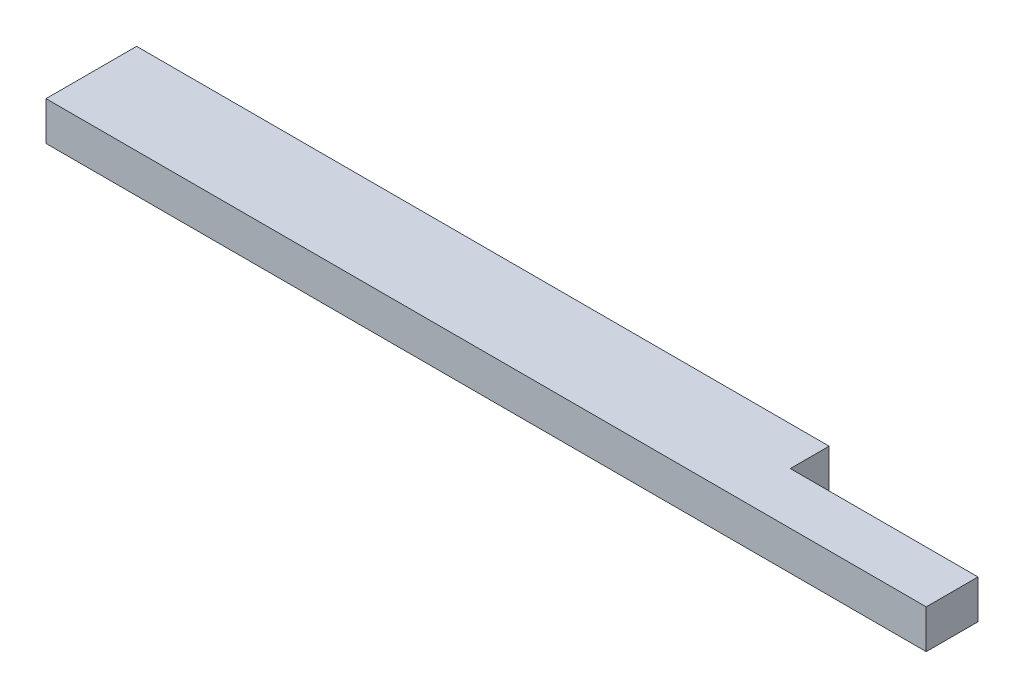
ISO-10303-21;
HEADER;
FILE_DESCRIPTION(('STEP AP214'),'2;1');
FILE_NAME('part.step','',(''),(''),'','','');
FILE_SCHEMA(('AUTOMOTIVE_DESIGN { 1 0 10303 214 1 1 1 1 }'));
ENDSEC;
DATA;
#1=APPLICATION_CONTEXT('core data for automotive mechanical design processes');
#2=APPLICATION_PROTOCOL_DEFINITION('international standard','automotive_design',2000,#1);
#3=PRODUCT_CONTEXT('',#1,'mechanical');
#4=PRODUCT('Part','Part','',(#3));
#5=PRODUCT_RELATED_PRODUCT_CATEGORY('part','',(#4));
#6=PRODUCT_DEFINITION_FORMATION('','',#4);
#7=PRODUCT_DEFINITION_CONTEXT('part definition',#1,'design');
#8=PRODUCT_DEFINITION('design','',#6,#7);
#9=PRODUCT_DEFINITION_SHAPE('','',#8);
#10=(LENGTH_UNIT() NAMED_UNIT(*) SI_UNIT(.MILLI.,.METRE.));
#11=(NAMED_UNIT(*) PLANE_ANGLE_UNIT() SI_UNIT($,.RADIAN.));
#12=(NAMED_UNIT(*) SI_UNIT($,.STERADIAN.) SOLID_ANGLE_UNIT());
#13=UNCERTAINTY_MEASURE_WITH_UNIT(LENGTH_MEASURE(1.E-05),#10,'distance_accuracy_value','');
#14=(GEOMETRIC_REPRESENTATION_CONTEXT(3) GLOBAL_UNCERTAINTY_ASSIGNED_CONTEXT((#13)) GLOBAL_UNIT_ASSIGNED_CONTEXT((#10,
#11,#12)) REPRESENTATION_CONTEXT('',''));
#15=CARTESIAN_POINT('',(0.,0.,0.));
#16=DIRECTION('',(0.,0.,1.));
#17=DIRECTION('',(1.,0.,0.));
#18=AXIS2_PLACEMENT_3D('',#15,#16,#17);
#19=CARTESIAN_POINT('',(0.,38.1,0.));
#20=DIRECTION('',(1.,0.,0.));
#21=DIRECTION('',(0.,0.,-1.));
#22=AXIS2_PLACEMENT_3D('',#19,#20,#21);
#23=PLANE('',#22);
#24=DIRECTION('',(0.,0.,1.));
#25=VECTOR('',#24,1.);
#26=CARTESIAN_POINT('',(0.,0.,0.));
#27=LINE('',#26,#25);
#28=CARTESIAN_POINT('',(0.,0.,-88.9));
#29=VERTEX_POINT('',#28);
#30=CARTESIAN_POINT('',(0.,0.,0.));
#31=VERTEX_POINT('',#30);
#32=EDGE_CURVE('E113',#29,#31,#27,.T.);
#33=ORIENTED_EDGE('',*,*,#32,.T.);
#34=DIRECTION('',(0.,-1.,0.));
#35=VECTOR('',#34,1.);
#36=CARTESIAN_POINT('',(0.,38.1,0.));
#37=LINE('',#36,#35);
#38=CARTESIAN_POINT('',(0.,38.1,0.));
#39=VERTEX_POINT('',#38);
#40=EDGE_CURVE('E11',#39,#31,#37,.T.);
#41=ORIENTED_EDGE('',*,*,#40,.F.);
#42=DIRECTION('',(0.,0.,1.));
#43=VECTOR('',#42,1.);
#44=CARTESIAN_POINT('',(0.,38.1,0.));
#45=LINE('',#44,#43);
#46=CARTESIAN_POINT('',(0.,38.1,-88.9));
#47=VERTEX_POINT('',#46);
#48=EDGE_CURVE('E114',#47,#39,#45,.T.);
#49=ORIENTED_EDGE('',*,*,#48,.F.);
#50=DIRECTION('',(0.,-1.,0.));
#51=VECTOR('',#50,1.);
#52=CARTESIAN_POINT('',(0.,38.1,-88.9));
#53=LINE('',#52,#51);
#54=EDGE_CURVE('E123',#47,#29,#53,.T.);
#55=ORIENTED_EDGE('',*,*,#54,.T.);
#56=EDGE_LOOP('',(#33,#41,#49,#55));
#57=FACE_BOUND('',#56,.T.);
#58=ADVANCED_FACE('F39',(#57),#23,.F.);
#59=CARTESIAN_POINT('',(0.,38.1,0.));
#60=DIRECTION('',(0.,0.,-1.));
#61=DIRECTION('',(-1.,0.,0.));
#62=AXIS2_PLACEMENT_3D('',#59,#60,#61);
#63=PLANE('',#62);
#64=DIRECTION('',(1.,0.,0.));
#65=VECTOR('',#64,1.);
#66=CARTESIAN_POINT('',(0.,0.,0.));
#67=LINE('',#66,#65);
#68=CARTESIAN_POINT('',(863.6,0.,0.));
#69=VERTEX_POINT('',#68);
#70=EDGE_CURVE('E119',#31,#69,#67,.T.);
#71=ORIENTED_EDGE('',*,*,#70,.T.);
#72=DIRECTION('',(0.,-1.,0.));
#73=VECTOR('',#72,1.);
#74=CARTESIAN_POINT('',(863.6,38.1,0.));
#75=LINE('',#74,#73);
#76=CARTESIAN_POINT('',(863.6,38.1,0.));
#77=VERTEX_POINT('',#76);
#78=EDGE_CURVE('E46',#77,#69,#75,.T.);
#79=ORIENTED_EDGE('',*,*,#78,.F.);
#80=DIRECTION('',(1.,0.,0.));
#81=VECTOR('',#80,1.);
#82=CARTESIAN_POINT('',(0.,38.1,0.));
#83=LINE('',#82,#81);
#84=EDGE_CURVE('E85',#39,#77,#83,.T.);
#85=ORIENTED_EDGE('',*,*,#84,.F.);
#86=ORIENTED_EDGE('',*,*,#40,.T.);
#87=EDGE_LOOP('',(#71,#79,#85,#86));
#88=FACE_BOUND('',#87,.T.);
#89=ADVANCED_FACE('F143',(#88),#63,.F.);
#90=CARTESIAN_POINT('',(863.6,38.1,0.));
#91=DIRECTION('',(-1.,0.,0.));
#92=DIRECTION('',(0.,0.,1.));
#93=AXIS2_PLACEMENT_3D('',#90,#91,#92);
#94=PLANE('',#93);
#95=DIRECTION('',(0.,0.,-1.));
#96=VECTOR('',#95,1.);
#97=CARTESIAN_POINT('',(863.6,0.,0.));
#98=LINE('',#97,#96);
#99=CARTESIAN_POINT('',(863.6,0.,-50.8));
#100=VERTEX_POINT('',#99);
#101=EDGE_CURVE('E115',#69,#100,#98,.T.);
#102=ORIENTED_EDGE('',*,*,#101,.T.);
#103=DIRECTION('',(0.,1.,0.));
#104=VECTOR('',#103,1.);
#105=CARTESIAN_POINT('',(863.6,0.,-50.8));
#106=LINE('',#105,#104);
#107=CARTESIAN_POINT('',(863.6,38.1,-50.8));
#108=VERTEX_POINT('',#107);
#109=EDGE_CURVE('E137',#100,#108,#106,.T.);
#110=ORIENTED_EDGE('',*,*,#109,.T.);
#111=DIRECTION('',(0.,0.,-1.));
#112=VECTOR('',#111,1.);
#113=CARTESIAN_POINT('',(863.6,38.1,0.));
#114=LINE('',#113,#112);
#115=EDGE_CURVE('E131',#77,#108,#114,.T.);
#116=ORIENTED_EDGE('',*,*,#115,.F.);
#117=ORIENTED_EDGE('',*,*,#78,.T.);
#118=EDGE_LOOP('',(#102,#110,#116,#117));
#119=FACE_BOUND('',#118,.T.);
#120=ADVANCED_FACE('F128',(#119),#94,.F.);
#121=CARTESIAN_POINT('',(0.,38.1,-88.9));
#122=DIRECTION('',(0.,0.,1.));
#123=DIRECTION('',(1.,0.,0.));
#124=AXIS2_PLACEMENT_3D('',#121,#122,#123);
#125=PLANE('',#124);
#126=DIRECTION('',(-1.,0.,0.));
#127=VECTOR('',#126,1.);
#128=CARTESIAN_POINT('',(0.,38.1,-88.9));
#129=LINE('',#128,#127);
#130=CARTESIAN_POINT('',(679.45,38.1,-88.8999999999999));
#131=VERTEX_POINT('',#130);
#132=EDGE_CURVE('E62',#131,#47,#129,.T.);
#133=ORIENTED_EDGE('',*,*,#132,.F.);
#134=DIRECTION('',(0.,1.,0.));
#135=VECTOR('',#134,1.);
#136=CARTESIAN_POINT('',(679.45,0.,-88.8999999999999));
#137=LINE('',#136,#135);
#138=CARTESIAN_POINT('',(679.45,0.,-88.8999999999999));
#139=VERTEX_POINT('',#138);
#140=EDGE_CURVE('E103',#139,#131,#137,.T.);
#141=ORIENTED_EDGE('',*,*,#140,.F.);
#142=DIRECTION('',(-1.,0.,0.));
#143=VECTOR('',#142,1.);
#144=CARTESIAN_POINT('',(0.,0.,-88.9));
#145=LINE('',#144,#143);
#146=EDGE_CURVE('E80',#139,#29,#145,.T.);
#147=ORIENTED_EDGE('',*,*,#146,.T.);
#148=ORIENTED_EDGE('',*,*,#54,.F.);
#149=EDGE_LOOP('',(#133,#141,#147,#148));
#150=FACE_BOUND('',#149,.T.);
#151=ADVANCED_FACE('F108',(#150),#125,.F.);
#152=CARTESIAN_POINT('',(0.,38.1,0.));
#153=DIRECTION('',(0.,-1.,0.));
#154=DIRECTION('',(0.,0.,-1.));
#155=AXIS2_PLACEMENT_3D('',#152,#153,#154);
#156=PLANE('',#155);
#157=ORIENTED_EDGE('',*,*,#115,.T.);
#158=DIRECTION('',(1.,0.,0.));
#159=VECTOR('',#158,1.);
#160=CARTESIAN_POINT('',(863.6,38.1,-50.8));
#161=LINE('',#160,#159);
#162=CARTESIAN_POINT('',(679.45,38.1,-50.8));
#163=VERTEX_POINT('',#162);
#164=EDGE_CURVE('E106',#163,#108,#161,.T.);
#165=ORIENTED_EDGE('',*,*,#164,.F.);
#166=DIRECTION('',(0.,0.,1.));
#167=VECTOR('',#166,1.);
#168=CARTESIAN_POINT('',(679.45,38.1,-88.8999999999999));
#169=LINE('',#168,#167);
#170=EDGE_CURVE('E134',#131,#163,#169,.T.);
#171=ORIENTED_EDGE('',*,*,#170,.F.);
#172=ORIENTED_EDGE('',*,*,#132,.T.);
#173=ORIENTED_EDGE('',*,*,#48,.T.);
#174=ORIENTED_EDGE('',*,*,#84,.T.);
#175=EDGE_LOOP('',(#157,#165,#171,#172,#173,#174));
#176=FACE_BOUND('',#175,.T.);
#177=ADVANCED_FACE('F147',(#176),#156,.F.);
#178=CARTESIAN_POINT('',(0.,0.,0.));
#179=DIRECTION('',(0.,-1.,0.));
#180=DIRECTION('',(0.,0.,-1.));
#181=AXIS2_PLACEMENT_3D('',#178,#179,#180);
#182=PLANE('',#181);
#183=DIRECTION('',(1.,0.,0.));
#184=VECTOR('',#183,1.);
#185=CARTESIAN_POINT('',(863.6,0.,-50.8));
#186=LINE('',#185,#184);
#187=CARTESIAN_POINT('',(679.45,0.,-50.8));
#188=VERTEX_POINT('',#187);
#189=EDGE_CURVE('E53',#188,#100,#186,.T.);
#190=ORIENTED_EDGE('',*,*,#189,.T.);
#191=ORIENTED_EDGE('',*,*,#101,.F.);
#192=ORIENTED_EDGE('',*,*,#70,.F.);
#193=ORIENTED_EDGE('',*,*,#32,.F.);
#194=ORIENTED_EDGE('',*,*,#146,.F.);
#195=DIRECTION('',(0.,0.,1.));
#196=VECTOR('',#195,1.);
#197=CARTESIAN_POINT('',(679.45,0.,-88.8999999999999));
#198=LINE('',#197,#196);
#199=EDGE_CURVE('E100',#139,#188,#198,.T.);
#200=ORIENTED_EDGE('',*,*,#199,.T.);
#201=EDGE_LOOP('',(#190,#191,#192,#193,#194,#200));
#202=FACE_BOUND('',#201,.T.);
#203=ADVANCED_FACE('F111',(#202),#182,.T.);
#204=CARTESIAN_POINT('',(863.6,0.,-50.8));
#205=DIRECTION('',(0.,0.,1.));
#206=DIRECTION('',(1.,0.,0.));
#207=AXIS2_PLACEMENT_3D('',#204,#205,#206);
#208=PLANE('',#207);
#209=ORIENTED_EDGE('',*,*,#164,.T.);
#210=ORIENTED_EDGE('',*,*,#109,.F.);
#211=ORIENTED_EDGE('',*,*,#189,.F.);
#212=DIRECTION('',(0.,1.,0.));
#213=VECTOR('',#212,1.);
#214=CARTESIAN_POINT('',(679.45,0.,-50.8));
#215=LINE('',#214,#213);
#216=EDGE_CURVE('E104',#188,#163,#215,.T.);
#217=ORIENTED_EDGE('',*,*,#216,.T.);
#218=EDGE_LOOP('',(#209,#210,#211,#217));
#219=FACE_BOUND('',#218,.T.);
#220=ADVANCED_FACE('F149',(#219),#208,.F.);
#221=CARTESIAN_POINT('',(679.45,0.,-88.8999999999999));
#222=DIRECTION('',(-1.,0.,0.));
#223=DIRECTION('',(0.,0.,1.));
#224=AXIS2_PLACEMENT_3D('',#221,#222,#223);
#225=PLANE('',#224);
#226=ORIENTED_EDGE('',*,*,#170,.T.);
#227=ORIENTED_EDGE('',*,*,#216,.F.);
#228=ORIENTED_EDGE('',*,*,#199,.F.);
#229=ORIENTED_EDGE('',*,*,#140,.T.);
#230=EDGE_LOOP('',(#226,#227,#228,#229));
#231=FACE_BOUND('',#230,.T.);
#232=ADVANCED_FACE('F102',(#231),#225,.F.);
#233=CLOSED_SHELL('',(#58,#89,#120,#151,#177,#203,#220,#232));
#234=MANIFOLD_SOLID_BREP('B2',#233);
#235=ADVANCED_BREP_SHAPE_REPRESENTATION('',(#18,#234),#14);
#236=SHAPE_DEFINITION_REPRESENTATION(#9,#235);
ENDSEC;
END-ISO-10303-21;
